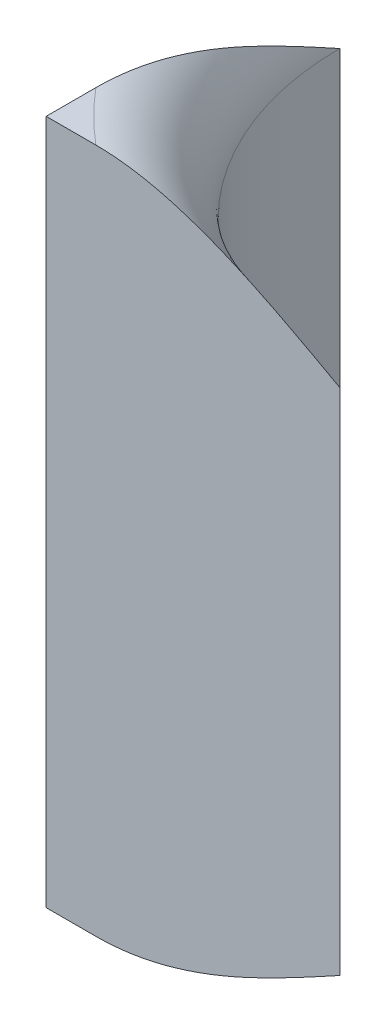
ISO-10303-21;
HEADER;
FILE_DESCRIPTION(('STEP AP214'),'2;1');
FILE_NAME('part.step','',(''),(''),'','','');
FILE_SCHEMA(('AUTOMOTIVE_DESIGN { 1 0 10303 214 1 1 1 1 }'));
ENDSEC;
DATA;
#1=APPLICATION_CONTEXT('core data for automotive mechanical design processes');
#2=APPLICATION_PROTOCOL_DEFINITION('international standard','automotive_design',2000,#1);
#3=PRODUCT_CONTEXT('',#1,'mechanical');
#4=PRODUCT('Part','Part','',(#3));
#5=PRODUCT_RELATED_PRODUCT_CATEGORY('part','',(#4));
#6=PRODUCT_DEFINITION_FORMATION('','',#4);
#7=PRODUCT_DEFINITION_CONTEXT('part definition',#1,'design');
#8=PRODUCT_DEFINITION('design','',#6,#7);
#9=PRODUCT_DEFINITION_SHAPE('','',#8);
#10=(LENGTH_UNIT() NAMED_UNIT(*) SI_UNIT(.MILLI.,.METRE.));
#11=(NAMED_UNIT(*) PLANE_ANGLE_UNIT() SI_UNIT($,.RADIAN.));
#12=(NAMED_UNIT(*) SI_UNIT($,.STERADIAN.) SOLID_ANGLE_UNIT());
#13=UNCERTAINTY_MEASURE_WITH_UNIT(LENGTH_MEASURE(1.E-05),#10,'distance_accuracy_value','');
#14=(GEOMETRIC_REPRESENTATION_CONTEXT(3) GLOBAL_UNCERTAINTY_ASSIGNED_CONTEXT((#13)) GLOBAL_UNIT_ASSIGNED_CONTEXT((#10,
#11,#12)) REPRESENTATION_CONTEXT('',''));
#15=CARTESIAN_POINT('',(0.,0.,0.));
#16=DIRECTION('',(0.,0.,1.));
#17=DIRECTION('',(1.,0.,0.));
#18=AXIS2_PLACEMENT_3D('',#15,#16,#17);
#19=CARTESIAN_POINT('',(3.9,2.46,-7.3));
#20=DIRECTION('',(0.,1.,0.));
#21=DIRECTION('',(0.,0.,1.));
#22=AXIS2_PLACEMENT_3D('',#19,#20,#21);
#23=TOROIDAL_SURFACE('',#22,0.389999999999998,0.0899999999999997);
#24=CARTESIAN_POINT('',(3.6,2.55,-7.05080128411138));
#25=CARTESIAN_POINT('',(3.6,2.54996873881584,-7.06539050320359));
#26=CARTESIAN_POINT('',(3.6,2.54856309488378,-7.07987147393059));
#27=CARTESIAN_POINT('',(3.6,2.54368423695863,-7.10829216976646));
#28=CARTESIAN_POINT('',(3.6,2.54023956259985,-7.12223658857575));
#29=CARTESIAN_POINT('',(3.6,2.52752219042688,-7.16420253695043));
#30=CARTESIAN_POINT('',(3.6,2.51594220810303,-7.19147802039734));
#31=CARTESIAN_POINT('',(3.6,2.49015615109005,-7.2448356545228));
#32=CARTESIAN_POINT('',(3.6,2.47593214013178,-7.27090803790896));
#33=CARTESIAN_POINT('',(3.6,2.46110939531161,-7.29797451018031));
#34=CARTESIAN_POINT('',(3.6,2.46055469450968,-7.29898724918841));
#35=CARTESIAN_POINT('',(3.6,2.46,-7.3));
#36=B_SPLINE_CURVE_WITH_KNOTS('',3,(#24,#25,#26,#27,#28,#29,#30,#31,#32,#33,#34,#35),
.UNSPECIFIED.,.F.,.F.,(4,2,2,2,2,4),(0.,0.0435527295939771,0.0865098187320563,0.175000963365766,
0.264115894109955,0.267579995726729),.UNSPECIFIED.);
#37=CARTESIAN_POINT('',(3.6,2.55,-7.05080128411192));
#38=VERTEX_POINT('',#37);
#39=CARTESIAN_POINT('',(3.6,2.46,-7.3));
#40=VERTEX_POINT('',#39);
#41=EDGE_CURVE('E67',#38,#40,#36,.T.);
#42=ORIENTED_EDGE('',*,*,#41,.F.);
#43=CARTESIAN_POINT('',(3.9,2.55,-7.3));
#44=DIRECTION('',(0.,1.,0.));
#45=DIRECTION('',(0.,0.,1.));
#46=AXIS2_PLACEMENT_3D('',#43,#44,#45);
#47=CIRCLE('',#46,0.39);
#48=CARTESIAN_POINT('',(3.65080128411123,2.55,-7.));
#49=VERTEX_POINT('',#48);
#50=EDGE_CURVE('E21',#49,#38,#47,.F.);
#51=ORIENTED_EDGE('',*,*,#50,.F.);
#52=CARTESIAN_POINT('',(3.9,2.46,-7.));
#53=CARTESIAN_POINT('',(3.89898725661568,2.4605546933115,-7.));
#54=CARTESIAN_POINT('',(3.8979745173251,2.46110939416549,-7.));
#55=CARTESIAN_POINT('',(3.87049202919069,2.47615989168973,-6.99999999999999));
#56=CARTESIAN_POINT('',(3.84399834794992,2.49061098047869,-7.));
#57=CARTESIAN_POINT('',(3.78967717491194,2.5167594672462,-7.));
#58=CARTESIAN_POINT('',(3.76185568411189,2.52846806008293,-7.));
#59=CARTESIAN_POINT('',(3.71373742133395,2.5426386060633,-7.));
#60=CARTESIAN_POINT('',(3.69402727811991,2.54688228554531,-7.));
#61=CARTESIAN_POINT('',(3.66402445895714,2.54981614838478,-7.));
#62=CARTESIAN_POINT('',(3.65390597518063,2.55021635400833,-7.));
#63=CARTESIAN_POINT('',(3.63370986034958,2.5495579808952,-7.));
#64=CARTESIAN_POINT('',(3.62363219071495,2.54850159887963,-7.));
#65=CARTESIAN_POINT('',(3.60684979518927,2.54519918623927,-7.));
#66=CARTESIAN_POINT('',(3.6000549415783,2.54341502426509,-7.));
#67=CARTESIAN_POINT('',(3.58679600381802,2.53886646101216,-7.));
#68=CARTESIAN_POINT('',(3.58033161813731,2.53610297225816,-7.));
#69=CARTESIAN_POINT('',(3.5691456758505,2.53012138519624,-7.));
#70=CARTESIAN_POINT('',(3.56432582286341,2.52708831558088,-7.));
#71=CARTESIAN_POINT('',(3.55523875596396,2.52028079794344,-7.));
#72=CARTESIAN_POINT('',(3.55097085040484,2.51650729299448,-7.));
#73=CARTESIAN_POINT('',(3.54395259376659,2.50903441492666,-7.));
#74=CARTESIAN_POINT('',(3.54106831875637,2.50546117484758,-7.));
#75=CARTESIAN_POINT('',(3.53592638908621,2.49788615695021,-7.));
#76=CARTESIAN_POINT('',(3.53366846791901,2.49388456239997,-7.));
#77=CARTESIAN_POINT('',(3.52989142890798,2.48551161903109,-7.));
#78=CARTESIAN_POINT('',(3.528377215587,2.48113803302173,-7.));
#79=CARTESIAN_POINT('',(3.52621203743497,2.47218112849729,-7.));
#80=CARTESIAN_POINT('',(3.52556065799353,2.46759791181044,-7.));
#81=CARTESIAN_POINT('',(3.52518958858274,2.45891376678059,-7.));
#82=CARTESIAN_POINT('',(3.52537314245993,2.45481671703713,-7.));
#83=CARTESIAN_POINT('',(3.5264439157805,2.44671856100795,-7.));
#84=CARTESIAN_POINT('',(3.52733068805597,2.44271739541586,-7.));
#85=CARTESIAN_POINT('',(3.52972859349772,2.43501262320043,-7.));
#86=CARTESIAN_POINT('',(3.53122452010426,2.43130422631035,-7.));
#87=CARTESIAN_POINT('',(3.53476988704399,2.42415641295071,-7.));
#88=CARTESIAN_POINT('',(3.5368202788027,2.42071747205479,-7.));
#89=CARTESIAN_POINT('',(3.54160127423581,2.41386646883969,-7.));
#90=CARTESIAN_POINT('',(3.54437729315411,2.41048640398363,-7.));
#91=CARTESIAN_POINT('',(3.550367674953,2.40416465676449,-7.));
#92=CARTESIAN_POINT('',(3.55358018002081,2.40122122144442,-7.));
#93=CARTESIAN_POINT('',(3.55696253280322,2.39850407393578,-7.));
#94=B_SPLINE_CURVE_WITH_KNOTS('',3,(#52,#53,#54,#55,#56,#57,#58,#59,#60,#61,#62,#63,#64,#65,#66,
#67,#68,#69,#70,#71,#72,#73,#74,#75,#76,#77,#78,#79,#80,#81,#82,#83,#84,#85,#86,#87,#88,#89,#90,
#91,#92,#93),.UNSPECIFIED.,.F.,.F.,(4,2,2,2,2,2,2,2,2,2,2,2,2,2,2,2,2,2,2,2,4),(0.,
0.00346410161608665,0.0940013231415754,0.184162267737879,0.24424021102799,0.274541767257791,
0.304797674801022,0.325813063735686,0.346808922053323,0.363831063314088,0.38083166302512,
0.394552608315542,0.408267706495767,0.422072076080108,0.435869809956177,0.448112045060006,
0.460346501713533,0.472292633881982,0.484259396344651,0.497334648987113,0.510355897946335),.UNSPECIFIED.);
#95=CARTESIAN_POINT('',(3.89999999999999,2.46,-7.));
#96=VERTEX_POINT('',#95);
#97=EDGE_CURVE('E64',#96,#49,#94,.T.);
#98=ORIENTED_EDGE('',*,*,#97,.F.);
#99=CARTESIAN_POINT('',(3.9,2.46,-7.3));
#100=DIRECTION('',(0.,1.,0.));
#101=DIRECTION('',(0.,0.,1.));
#102=AXIS2_PLACEMENT_3D('',#99,#100,#101);
#103=CIRCLE('',#102,0.299999999999999);
#104=EDGE_CURVE('E71',#40,#96,#103,.T.);
#105=ORIENTED_EDGE('',*,*,#104,.F.);
#106=EDGE_LOOP('',(#42,#51,#98,#105));
#107=FACE_BOUND('',#106,.T.);
#108=ADVANCED_FACE('F17',(#107),#23,.T.);
#109=CARTESIAN_POINT('',(3.599,2.55,-7.051801284111));
#110=DIRECTION('',(0.,1.,0.));
#111=DIRECTION('',(0.,0.,1.));
#112=AXIS2_PLACEMENT_3D('',#109,#110,#111);
#113=PLANE('',#112);
#114=DIRECTION('',(-1.,0.,0.));
#115=VECTOR('',#114,1.);
#116=CARTESIAN_POINT('',(3.75,2.55,-7.));
#117=LINE('',#116,#115);
#118=CARTESIAN_POINT('',(3.6,2.55,-7.));
#119=VERTEX_POINT('',#118);
#120=EDGE_CURVE('E73',#49,#119,#117,.T.);
#121=ORIENTED_EDGE('',*,*,#120,.F.);
#122=ORIENTED_EDGE('',*,*,#50,.T.);
#123=DIRECTION('',(0.,0.,-1.));
#124=VECTOR('',#123,1.);
#125=CARTESIAN_POINT('',(3.6,2.55,-7.15));
#126=LINE('',#125,#124);
#127=EDGE_CURVE('E75',#119,#38,#126,.T.);
#128=ORIENTED_EDGE('',*,*,#127,.F.);
#129=EDGE_LOOP('',(#121,#122,#128));
#130=FACE_BOUND('',#129,.T.);
#131=ADVANCED_FACE('F74',(#130),#113,.T.);
#132=CARTESIAN_POINT('',(3.9,2.46,-7.3));
#133=DIRECTION('',(0.,-1.,0.));
#134=DIRECTION('',(0.,0.,-1.));
#135=AXIS2_PLACEMENT_3D('',#132,#133,#134);
#136=CYLINDRICAL_SURFACE('',#135,0.299999999999999);
#137=CARTESIAN_POINT('',(3.9,1.94,-7.3));
#138=DIRECTION('',(0.,1.,0.));
#139=DIRECTION('',(-1.,0.,0.));
#140=AXIS2_PLACEMENT_3D('',#137,#138,#139);
#141=CIRCLE('',#140,0.299999999999999);
#142=CARTESIAN_POINT('',(3.6,1.94,-7.3));
#143=VERTEX_POINT('',#142);
#144=CARTESIAN_POINT('',(3.9,1.94,-7.));
#145=VERTEX_POINT('',#144);
#146=EDGE_CURVE('E122',#143,#145,#141,.T.);
#147=ORIENTED_EDGE('',*,*,#146,.F.);
#148=DIRECTION('',(0.,-1.,0.));
#149=VECTOR('',#148,1.);
#150=CARTESIAN_POINT('',(3.6,2.20000000000023,-7.3));
#151=LINE('',#150,#149);
#152=EDGE_CURVE('E82',#40,#143,#151,.T.);
#153=ORIENTED_EDGE('',*,*,#152,.F.);
#154=ORIENTED_EDGE('',*,*,#104,.T.);
#155=DIRECTION('',(0.,1.,0.));
#156=VECTOR('',#155,1.);
#157=CARTESIAN_POINT('',(3.9,2.19999999999976,-7.));
#158=LINE('',#157,#156);
#159=EDGE_CURVE('E78',#145,#96,#158,.T.);
#160=ORIENTED_EDGE('',*,*,#159,.F.);
#161=EDGE_LOOP('',(#147,#153,#154,#160));
#162=FACE_BOUND('',#161,.T.);
#163=ADVANCED_FACE('F102',(#162),#136,.F.);
#164=CARTESIAN_POINT('',(3.599,2.55100000000047,-7.));
#165=DIRECTION('',(0.,0.,1.));
#166=DIRECTION('',(0.,-1.,0.));
#167=AXIS2_PLACEMENT_3D('',#164,#165,#166);
#168=PLANE('',#167);
#169=ORIENTED_EDGE('',*,*,#159,.T.);
#170=ORIENTED_EDGE('',*,*,#97,.T.);
#171=ORIENTED_EDGE('',*,*,#120,.T.);
#172=DIRECTION('',(0.,1.,0.));
#173=VECTOR('',#172,1.);
#174=CARTESIAN_POINT('',(3.6,2.20000000000023,-7.));
#175=LINE('',#174,#173);
#176=CARTESIAN_POINT('',(3.6,1.85,-7.));
#177=VERTEX_POINT('',#176);
#178=EDGE_CURVE('E133',#177,#119,#175,.T.);
#179=ORIENTED_EDGE('',*,*,#178,.F.);
#180=DIRECTION('',(-1.,0.,0.));
#181=VECTOR('',#180,1.);
#182=CARTESIAN_POINT('',(3.6254006420555,1.85,-7.));
#183=LINE('',#182,#181);
#184=CARTESIAN_POINT('',(3.65080128411123,1.85,-7.));
#185=VERTEX_POINT('',#184);
#186=EDGE_CURVE('E120',#185,#177,#183,.T.);
#187=ORIENTED_EDGE('',*,*,#186,.F.);
#188=CARTESIAN_POINT('',(3.65080128411139,1.85,-7.));
#189=CARTESIAN_POINT('',(3.66539050320357,1.85003126118417,-7.));
#190=CARTESIAN_POINT('',(3.67987147393057,1.85143690511623,-7.));
#191=CARTESIAN_POINT('',(3.70829216976644,1.85631576304136,-7.));
#192=CARTESIAN_POINT('',(3.72223658857574,1.85976043740014,-7.));
#193=CARTESIAN_POINT('',(3.76420253695043,1.87247780957313,-7.));
#194=CARTESIAN_POINT('',(3.79147802039731,1.88405779189706,-7.));
#195=CARTESIAN_POINT('',(3.84483565452285,1.90984384890988,-7.));
#196=CARTESIAN_POINT('',(3.87090803790913,1.92406785986792,-7.));
#197=CARTESIAN_POINT('',(3.89797451018032,1.93889060468837,-7.));
#198=CARTESIAN_POINT('',(3.89898724918841,1.93944530549031,-7.));
#199=CARTESIAN_POINT('',(3.9,1.94,-7.));
#200=B_SPLINE_CURVE_WITH_KNOTS('',3,(#188,#189,#190,#191,#192,#193,#194,#195,#196,#197,#198,
#199),.UNSPECIFIED.,.F.,.F.,(4,2,2,2,2,4),(0.,0.0435527295939446,0.0865098187320553,
0.175000963365783,0.264115894109955,0.267579995726729),.UNSPECIFIED.);
#201=EDGE_CURVE('E132',#145,#185,#200,.F.);
#202=ORIENTED_EDGE('',*,*,#201,.F.);
#203=EDGE_LOOP('',(#169,#170,#171,#179,#187,#202));
#204=FACE_BOUND('',#203,.T.);
#205=ADVANCED_FACE('F80',(#204),#168,.T.);
#206=CARTESIAN_POINT('',(3.6,1.84899999999953,-6.999));
#207=DIRECTION('',(-1.,0.,0.));
#208=DIRECTION('',(0.,1.,0.));
#209=AXIS2_PLACEMENT_3D('',#206,#207,#208);
#210=PLANE('',#209);
#211=ORIENTED_EDGE('',*,*,#178,.T.);
#212=ORIENTED_EDGE('',*,*,#127,.T.);
#213=ORIENTED_EDGE('',*,*,#41,.T.);
#214=ORIENTED_EDGE('',*,*,#152,.T.);
#215=CARTESIAN_POINT('',(3.6,1.85,-7.05080128411138));
#216=CARTESIAN_POINT('',(3.6,1.85003126118415,-7.0653905032036));
#217=CARTESIAN_POINT('',(3.6,1.85143690511622,-7.07987147393061));
#218=CARTESIAN_POINT('',(3.6,1.85631576304138,-7.10829216976647));
#219=CARTESIAN_POINT('',(3.6,1.85976043740015,-7.12223658857575));
#220=CARTESIAN_POINT('',(3.6,1.87247780957311,-7.16420253695043));
#221=CARTESIAN_POINT('',(3.6,1.88405779189692,-7.19147802039736));
#222=CARTESIAN_POINT('',(3.6,1.90984384891001,-7.24483565452276));
#223=CARTESIAN_POINT('',(3.6,1.92406785986843,-7.27090803790884));
#224=CARTESIAN_POINT('',(3.6,1.93889060468841,-7.2979745101803));
#225=CARTESIAN_POINT('',(3.6,1.93944530549033,-7.29898724918841));
#226=CARTESIAN_POINT('',(3.6,1.94,-7.3));
#227=B_SPLINE_CURVE_WITH_KNOTS('',3,(#215,#216,#217,#218,#219,#220,#221,#222,#223,#224,#225,
#226),.UNSPECIFIED.,.F.,.F.,(4,2,2,2,2,4),(0.,0.043552729593999,0.0865098187320554,
0.175000963365754,0.264115894109956,0.267579995726728),.UNSPECIFIED.);
#228=CARTESIAN_POINT('',(3.6,1.85,-7.05080128411192));
#229=VERTEX_POINT('',#228);
#230=EDGE_CURVE('E36',#229,#143,#227,.T.);
#231=ORIENTED_EDGE('',*,*,#230,.F.);
#232=DIRECTION('',(0.,0.,-1.));
#233=VECTOR('',#232,1.);
#234=CARTESIAN_POINT('',(3.6,1.85,-7.0254006420555));
#235=LINE('',#234,#233);
#236=EDGE_CURVE('E27',#177,#229,#235,.T.);
#237=ORIENTED_EDGE('',*,*,#236,.F.);
#238=EDGE_LOOP('',(#211,#212,#213,#214,#231,#237));
#239=FACE_BOUND('',#238,.T.);
#240=ADVANCED_FACE('F109',(#239),#210,.T.);
#241=CARTESIAN_POINT('',(3.9,1.94,-7.3));
#242=DIRECTION('',(0.,-1.,0.));
#243=DIRECTION('',(1.,0.,0.));
#244=AXIS2_PLACEMENT_3D('',#241,#242,#243);
#245=TOROIDAL_SURFACE('',#244,0.389999999999999,0.0899999999999996);
#246=ORIENTED_EDGE('',*,*,#230,.T.);
#247=ORIENTED_EDGE('',*,*,#146,.T.);
#248=ORIENTED_EDGE('',*,*,#201,.T.);
#249=CARTESIAN_POINT('',(3.9,1.85,-7.3));
#250=DIRECTION('',(0.,-1.,0.));
#251=DIRECTION('',(1.,0.,0.));
#252=AXIS2_PLACEMENT_3D('',#249,#250,#251);
#253=CIRCLE('',#252,0.39);
#254=EDGE_CURVE('E11',#229,#185,#253,.F.);
#255=ORIENTED_EDGE('',*,*,#254,.F.);
#256=EDGE_LOOP('',(#246,#247,#248,#255));
#257=FACE_BOUND('',#256,.T.);
#258=ADVANCED_FACE('F112',(#257),#245,.T.);
#259=CARTESIAN_POINT('',(3.599,1.85,-6.999));
#260=DIRECTION('',(0.,-1.,0.));
#261=DIRECTION('',(0.,0.,-1.));
#262=AXIS2_PLACEMENT_3D('',#259,#260,#261);
#263=PLANE('',#262);
#264=ORIENTED_EDGE('',*,*,#236,.T.);
#265=ORIENTED_EDGE('',*,*,#254,.T.);
#266=ORIENTED_EDGE('',*,*,#186,.T.);
#267=EDGE_LOOP('',(#264,#265,#266));
#268=FACE_BOUND('',#267,.T.);
#269=ADVANCED_FACE('F19',(#268),#263,.T.);
#270=CLOSED_SHELL('',(#108,#131,#163,#205,#240,#258,#269));
#271=MANIFOLD_SOLID_BREP('B1',#270);
#272=ADVANCED_BREP_SHAPE_REPRESENTATION('',(#18,#271),#14);
#273=SHAPE_DEFINITION_REPRESENTATION(#9,#272);
ENDSEC;
END-ISO-10303-21;
